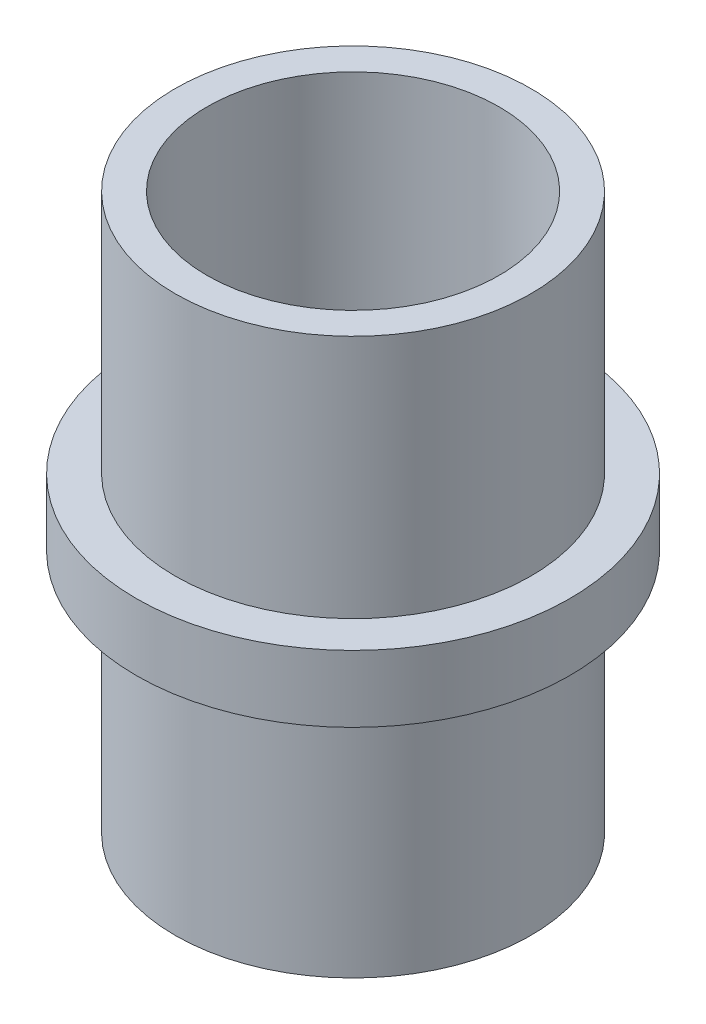
ISO-10303-21;
HEADER;
FILE_DESCRIPTION(('STEP AP214'),'2;1');
FILE_NAME('part.step','',(''),(''),'','','');
FILE_SCHEMA(('AUTOMOTIVE_DESIGN { 1 0 10303 214 1 1 1 1 }'));
ENDSEC;
DATA;
#1=APPLICATION_CONTEXT('core data for automotive mechanical design processes');
#2=APPLICATION_PROTOCOL_DEFINITION('international standard','automotive_design',2000,#1);
#3=PRODUCT_CONTEXT('',#1,'mechanical');
#4=PRODUCT('Part','Part','',(#3));
#5=PRODUCT_RELATED_PRODUCT_CATEGORY('part','',(#4));
#6=PRODUCT_DEFINITION_FORMATION('','',#4);
#7=PRODUCT_DEFINITION_CONTEXT('part definition',#1,'design');
#8=PRODUCT_DEFINITION('design','',#6,#7);
#9=PRODUCT_DEFINITION_SHAPE('','',#8);
#10=(LENGTH_UNIT() NAMED_UNIT(*) SI_UNIT(.MILLI.,.METRE.));
#11=(NAMED_UNIT(*) PLANE_ANGLE_UNIT() SI_UNIT($,.RADIAN.));
#12=(NAMED_UNIT(*) SI_UNIT($,.STERADIAN.) SOLID_ANGLE_UNIT());
#13=UNCERTAINTY_MEASURE_WITH_UNIT(LENGTH_MEASURE(1.E-05),#10,'distance_accuracy_value','');
#14=(GEOMETRIC_REPRESENTATION_CONTEXT(3) GLOBAL_UNCERTAINTY_ASSIGNED_CONTEXT((#13)) GLOBAL_UNIT_ASSIGNED_CONTEXT((#10,
#11,#12)) REPRESENTATION_CONTEXT('',''));
#15=CARTESIAN_POINT('',(0.,0.,0.));
#16=DIRECTION('',(0.,0.,1.));
#17=DIRECTION('',(1.,0.,0.));
#18=AXIS2_PLACEMENT_3D('',#15,#16,#17);
#19=CARTESIAN_POINT('',(0.,25.,0.));
#20=DIRECTION('',(0.,-1.,0.));
#21=DIRECTION('',(0.,0.,-1.));
#22=AXIS2_PLACEMENT_3D('',#19,#20,#21);
#23=CYLINDRICAL_SURFACE('',#22,16.);
#24=CARTESIAN_POINT('',(0.,-25.,0.));
#25=DIRECTION('',(0.,1.,0.));
#26=DIRECTION('',(0.,0.,1.));
#27=AXIS2_PLACEMENT_3D('',#24,#25,#26);
#28=CIRCLE('',#27,16.);
#29=CARTESIAN_POINT('',(0.,-25.,16.));
#30=VERTEX_POINT('',#29);
#31=EDGE_CURVE('E47',#30,#30,#28,.T.);
#32=ORIENTED_EDGE('',*,*,#31,.T.);
#33=EDGE_LOOP('',(#32));
#34=FACE_BOUND('',#33,.T.);
#35=CARTESIAN_POINT('',(0.,-3.,0.));
#36=DIRECTION('',(0.,1.,0.));
#37=DIRECTION('',(0.,0.,1.));
#38=AXIS2_PLACEMENT_3D('',#35,#36,#37);
#39=CIRCLE('',#38,16.);
#40=CARTESIAN_POINT('',(0.,-3.,16.));
#41=VERTEX_POINT('',#40);
#42=EDGE_CURVE('E10',#41,#41,#39,.T.);
#43=ORIENTED_EDGE('',*,*,#42,.F.);
#44=EDGE_LOOP('',(#43));
#45=FACE_BOUND('',#44,.T.);
#46=ADVANCED_FACE('F36',(#34,#45),#23,.T.);
#47=CARTESIAN_POINT('',(0.,25.,0.));
#48=DIRECTION('',(0.,1.,0.));
#49=DIRECTION('',(0.,0.,1.));
#50=AXIS2_PLACEMENT_3D('',#47,#48,#49);
#51=PLANE('',#50);
#52=CARTESIAN_POINT('',(0.,25.,0.));
#53=DIRECTION('',(0.,1.,0.));
#54=DIRECTION('',(0.,0.,1.));
#55=AXIS2_PLACEMENT_3D('',#52,#53,#54);
#56=CIRCLE('',#55,16.);
#57=CARTESIAN_POINT('',(0.,25.,16.));
#58=VERTEX_POINT('',#57);
#59=EDGE_CURVE('E43',#58,#58,#56,.T.);
#60=ORIENTED_EDGE('',*,*,#59,.T.);
#61=EDGE_LOOP('',(#60));
#62=FACE_BOUND('',#61,.T.);
#63=CARTESIAN_POINT('',(0.,25.,0.));
#64=DIRECTION('',(0.,1.,0.));
#65=DIRECTION('',(0.,0.,1.));
#66=AXIS2_PLACEMENT_3D('',#63,#64,#65);
#67=CIRCLE('',#66,13.1445);
#68=CARTESIAN_POINT('',(0.,25.,13.1445));
#69=VERTEX_POINT('',#68);
#70=EDGE_CURVE('E52',#69,#69,#67,.T.);
#71=ORIENTED_EDGE('',*,*,#70,.F.);
#72=EDGE_LOOP('',(#71));
#73=FACE_BOUND('',#72,.T.);
#74=ADVANCED_FACE('F105',(#62,#73),#51,.T.);
#75=CARTESIAN_POINT('',(0.,-25.,0.));
#76=DIRECTION('',(0.,1.,0.));
#77=DIRECTION('',(0.,0.,1.));
#78=AXIS2_PLACEMENT_3D('',#75,#76,#77);
#79=PLANE('',#78);
#80=ORIENTED_EDGE('',*,*,#31,.F.);
#81=EDGE_LOOP('',(#80));
#82=FACE_BOUND('',#81,.T.);
#83=CARTESIAN_POINT('',(0.,-25.,0.));
#84=DIRECTION('',(0.,1.,0.));
#85=DIRECTION('',(0.,0.,1.));
#86=AXIS2_PLACEMENT_3D('',#83,#84,#85);
#87=CIRCLE('',#86,13.1445);
#88=CARTESIAN_POINT('',(0.,-25.,13.1445));
#89=VERTEX_POINT('',#88);
#90=EDGE_CURVE('E54',#89,#89,#87,.T.);
#91=ORIENTED_EDGE('',*,*,#90,.T.);
#92=EDGE_LOOP('',(#91));
#93=FACE_BOUND('',#92,.T.);
#94=ADVANCED_FACE('F107',(#82,#93),#79,.F.);
#95=CARTESIAN_POINT('',(0.,3.,0.));
#96=DIRECTION('',(0.,1.,0.));
#97=DIRECTION('',(0.,0.,1.));
#98=AXIS2_PLACEMENT_3D('',#95,#96,#97);
#99=CIRCLE('',#98,16.);
#100=CARTESIAN_POINT('',(0.,3.,16.));
#101=VERTEX_POINT('',#100);
#102=EDGE_CURVE('E63',#101,#101,#99,.T.);
#103=ORIENTED_EDGE('',*,*,#102,.T.);
#104=EDGE_LOOP('',(#103));
#105=FACE_BOUND('',#104,.T.);
#106=ORIENTED_EDGE('',*,*,#59,.F.);
#107=EDGE_LOOP('',(#106));
#108=FACE_BOUND('',#107,.T.);
#109=ADVANCED_FACE('F38',(#105,#108),#23,.T.);
#110=CARTESIAN_POINT('',(0.,25.,0.));
#111=DIRECTION('',(0.,-1.,0.));
#112=DIRECTION('',(0.,0.,-1.));
#113=AXIS2_PLACEMENT_3D('',#110,#111,#112);
#114=CYLINDRICAL_SURFACE('',#113,13.1445);
#115=CARTESIAN_POINT('',(2.,0.,-12.9914541237692));
#116=CARTESIAN_POINT('',(1.99999540326032,-0.111641013446361,-12.9914560105317));
#117=CARTESIAN_POINT('',(1.99062059725548,-0.223346359076251,-12.9929087652028));
#118=CARTESIAN_POINT('',(1.95337981008824,-0.443632517787268,-12.9985587147258));
#119=CARTESIAN_POINT('',(1.92549591435574,-0.552210197328411,-13.0027585683812));
#120=CARTESIAN_POINT('',(1.85209166421764,-0.763020618672669,-13.0134162676637));
#121=CARTESIAN_POINT('',(1.80658499337819,-0.865258212085992,-13.0198723610086));
#122=CARTESIAN_POINT('',(1.69925941851024,-1.0606324803063,-13.0343130218612));
#123=CARTESIAN_POINT('',(1.63744270929411,-1.15377037733389,-13.042297383673));
#124=CARTESIAN_POINT('',(1.4987082723457,-1.32908235303009,-13.0589684492082));
#125=CARTESIAN_POINT('',(1.42168268312432,-1.41117063487943,-13.0676598924021));
#126=CARTESIAN_POINT('',(1.2549498927998,-1.56130948340432,-13.0847235374151));
#127=CARTESIAN_POINT('',(1.16524198832323,-1.62935927097631,-13.0930957214952));
#128=CARTESIAN_POINT('',(0.975140607841426,-1.74980669661211,-13.1086271879623));
#129=CARTESIAN_POINT('',(0.874696455380245,-1.80212522089739,-13.1157802638666));
#130=CARTESIAN_POINT('',(0.666319274849736,-1.88911718774773,-13.1280150318462));
#131=CARTESIAN_POINT('',(0.558386654054409,-1.92379158906707,-13.1330968364681));
#132=CARTESIAN_POINT('',(0.338980304740942,-1.97425065066266,-13.1405830418978));
#133=CARTESIAN_POINT('',(0.22754033831712,-1.990179045466,-13.1430078054685));
#134=CARTESIAN_POINT('',(0.00354483222252339,-2.00314033120742,-13.1449765342345));
#135=CARTESIAN_POINT('',(-0.109010643357356,-2.0001743015011,-13.144520663988));
#136=CARTESIAN_POINT('',(-0.331061226495416,-1.97554419760718,-13.1407957407721));
#137=CARTESIAN_POINT('',(-0.440573932925829,-1.95403476573691,-13.137549954908));
#138=CARTESIAN_POINT('',(-0.65441727942512,-1.89317126525896,-13.1286358216136));
#139=CARTESIAN_POINT('',(-0.758747782915367,-1.85381672661431,-13.1229674103721));
#140=CARTESIAN_POINT('',(-0.959732216494147,-1.75822240422397,-13.1098049884868));
#141=CARTESIAN_POINT('',(-1.05635478670677,-1.70191769010173,-13.1023039789832));
#142=CARTESIAN_POINT('',(-1.23883866807834,-1.57406872704859,-13.0863120213155));
#143=CARTESIAN_POINT('',(-1.32469925007181,-1.50252344639715,-13.07782100615));
#144=CARTESIAN_POINT('',(-1.48413371647281,-1.34536324665243,-13.0606942403334));
#145=CARTESIAN_POINT('',(-1.55757449219005,-1.25961329352903,-13.0520578945112));
#146=CARTESIAN_POINT('',(-1.68904475516849,-1.07693618437247,-13.0356975565115));
#147=CARTESIAN_POINT('',(-1.74707414224258,-0.980008955683409,-13.0279735702652));
#148=CARTESIAN_POINT('',(-1.84609338170574,-0.77758802636922,-13.0143125845104));
#149=CARTESIAN_POINT('',(-1.88706926216929,-0.672087385798994,-13.0083770513745));
#150=CARTESIAN_POINT('',(-1.95068287818991,-0.455590985669204,-12.9989907418615));
#151=CARTESIAN_POINT('',(-1.97332194551027,-0.344595625800696,-12.9955397850369));
#152=CARTESIAN_POINT('',(-1.99943613708535,-0.121445651919497,-12.9915476658772));
#153=CARTESIAN_POINT('',(-2.00310008261134,-0.00931362998938095,-12.9909778348409));
#154=CARTESIAN_POINT('',(-1.99166132005454,0.213962929558819,-12.9927363408862));
#155=CARTESIAN_POINT('',(-1.97655921174369,0.325107498622023,-12.9950645853441));
#156=CARTESIAN_POINT('',(-1.9281772859336,0.542667357892487,-13.00233055309));
#157=CARTESIAN_POINT('',(-1.89499179256298,0.649104116315826,-13.0072547315143));
#158=CARTESIAN_POINT('',(-1.81148332950313,0.854904583681825,-13.0191465407353));
#159=CARTESIAN_POINT('',(-1.7611594910007,0.954267933735512,-13.0261142751258));
#160=CARTESIAN_POINT('',(-1.64435017321235,1.14394670401394,-13.0413755336817));
#161=CARTESIAN_POINT('',(-1.57774261608489,1.23418613959437,-13.0496789021603));
#162=CARTESIAN_POINT('',(-1.43042604517261,1.40227385547233,-13.066646304704));
#163=CARTESIAN_POINT('',(-1.34971621017293,1.48012141365159,-13.0753103597506));
#164=CARTESIAN_POINT('',(-1.17565395528388,1.62189509577794,-13.0921126473338));
#165=CARTESIAN_POINT('',(-1.08219896184892,1.68569598639716,-13.1002457279962));
#166=CARTESIAN_POINT('',(-0.885788017201065,1.79669216691888,-13.114989313007));
#167=CARTESIAN_POINT('',(-0.782832332103547,1.84388792175486,-13.1215998599836));
#168=CARTESIAN_POINT('',(-0.57073118165908,1.92013466092894,-13.1325309968908));
#169=CARTESIAN_POINT('',(-0.461610661361911,1.94925375367337,-13.1368601730266));
#170=CARTESIAN_POINT('',(-0.239957819352454,1.9887408714026,-13.1427768615432));
#171=CARTESIAN_POINT('',(-0.127425730313675,1.99911017223594,-13.1443645604702));
#172=CARTESIAN_POINT('',(0.0966419845571877,2.00077152974065,-13.1446174396465));
#173=CARTESIAN_POINT('',(0.208176204704224,1.9922550692773,-13.1433119539983));
#174=CARTESIAN_POINT('',(0.428206858060825,1.95679755096329,-13.1379843914623));
#175=CARTESIAN_POINT('',(0.536703301823739,1.92985655712842,-13.1339623240133));
#176=CARTESIAN_POINT('',(0.747523447050995,1.85838335911471,-13.1236514793906));
#177=CARTESIAN_POINT('',(0.849851862561139,1.81386479060985,-13.1173644595675));
#178=CARTESIAN_POINT('',(1.04561655254692,1.70852069190517,-13.1032137280482));
#179=CARTESIAN_POINT('',(1.139052521433,1.64769460157021,-13.0953499621961));
#180=CARTESIAN_POINT('',(1.31535042796293,1.5107713719436,-13.0788248695553));
#181=CARTESIAN_POINT('',(1.39810202818488,1.4345329904455,-13.0701565996357));
#182=CARTESIAN_POINT('',(1.54970677038495,1.26924645455248,-13.053050406685));
#183=CARTESIAN_POINT('',(1.61855664731257,1.18019529925613,-13.0446125381689));
#184=CARTESIAN_POINT('',(1.74076286428721,0.991203531349238,-13.0288700386719));
#185=CARTESIAN_POINT('',(1.79402712671228,0.891202816676302,-13.0215722566867));
#186=CARTESIAN_POINT('',(1.88292345858472,0.683609691019864,-13.0090165852373));
#187=CARTESIAN_POINT('',(1.9185737421196,0.57602525427977,-13.0037565897798));
#188=CARTESIAN_POINT('',(1.96318223796475,0.389971147672344,-12.9970813004023));
#189=CARTESIAN_POINT('',(1.97696764792184,0.312647946307558,-12.9949823643144));
#190=CARTESIAN_POINT('',(1.99537808220644,0.156893745491239,-12.9921681223506));
#191=CARTESIAN_POINT('',(2.00000323064863,0.0784627610638357,-12.9914527977279));
#192=CARTESIAN_POINT('',(2.,0.,-12.9914541237692));
#193=B_SPLINE_CURVE_WITH_KNOTS('',3,(#115,#116,#117,#118,#119,#120,#121,#122,#123,#124,#125,
#126,#127,#128,#129,#130,#131,#132,#133,#134,#135,#136,#137,#138,#139,#140,#141,#142,#143,#144,
#145,#146,#147,#148,#149,#150,#151,#152,#153,#154,#155,#156,#157,#158,#159,#160,#161,#162,#163,
#164,#165,#166,#167,#168,#169,#170,#171,#172,#173,#174,#175,#176,#177,#178,#179,#180,#181,#182,
#183,#184,#185,#186,#187,#188,#189,#190,#191,#192),.UNSPECIFIED.,.T.,.F.,(4,2,2,2,2,2,2,2,2,2,2,
2,2,2,2,2,2,2,2,2,2,2,2,2,2,2,2,2,2,2,2,2,2,2,2,2,2,2,4),(0.,0.334636233759967,
0.669596828284552,1.0042978555757,1.33895386570624,1.67607451418428,2.01321386703868,
2.35202140399586,2.69081052871008,3.0269847133173,3.3631396939399,3.69651814012939,
4.02990536795852,4.36458630079505,4.6992898972898,5.03738007249228,5.37547244551408,
5.71384127464964,6.05218552658118,6.3871563578982,6.72211648366472,7.05534593055503,
7.3885922727319,7.72441797457518,8.06026323900444,8.39899130089748,8.73770987786035,
9.07514437529327,9.41255591079043,9.7465620849471,10.0805670986097,10.4143135178075,
10.7480714020862,11.0850391810841,11.4220860107352,11.7610856224558,12.0997339473096,
12.3349238457631,12.5701105575482),.UNSPECIFIED.);
#194=CARTESIAN_POINT('',(2.,0.,-12.9914541237692));
#195=VERTEX_POINT('',#194);
#196=EDGE_CURVE('E69',#195,#195,#193,.T.);
#197=ORIENTED_EDGE('',*,*,#196,.T.);
#198=EDGE_LOOP('',(#197));
#199=FACE_BOUND('',#198,.T.);
#200=ORIENTED_EDGE('',*,*,#70,.T.);
#201=EDGE_LOOP('',(#200));
#202=FACE_BOUND('',#201,.T.);
#203=ORIENTED_EDGE('',*,*,#90,.F.);
#204=EDGE_LOOP('',(#203));
#205=FACE_BOUND('',#204,.T.);
#206=ADVANCED_FACE('F94',(#199,#202,#205),#114,.F.);
#207=CARTESIAN_POINT('',(0.,3.,0.));
#208=DIRECTION('',(0.,1.,0.));
#209=DIRECTION('',(0.,0.,1.));
#210=AXIS2_PLACEMENT_3D('',#207,#208,#209);
#211=PLANE('',#210);
#212=CARTESIAN_POINT('',(0.,3.,0.));
#213=DIRECTION('',(0.,1.,0.));
#214=DIRECTION('',(0.,0.,1.));
#215=AXIS2_PLACEMENT_3D('',#212,#213,#214);
#216=CIRCLE('',#215,19.5);
#217=CARTESIAN_POINT('',(0.,3.,19.5));
#218=VERTEX_POINT('',#217);
#219=EDGE_CURVE('E57',#218,#218,#216,.T.);
#220=ORIENTED_EDGE('',*,*,#219,.T.);
#221=EDGE_LOOP('',(#220));
#222=FACE_BOUND('',#221,.T.);
#223=ORIENTED_EDGE('',*,*,#102,.F.);
#224=EDGE_LOOP('',(#223));
#225=FACE_BOUND('',#224,.T.);
#226=ADVANCED_FACE('F89',(#222,#225),#211,.T.);
#227=CARTESIAN_POINT('',(0.,-3.,0.));
#228=DIRECTION('',(0.,1.,0.));
#229=DIRECTION('',(0.,0.,1.));
#230=AXIS2_PLACEMENT_3D('',#227,#228,#229);
#231=PLANE('',#230);
#232=CARTESIAN_POINT('',(0.,-3.,0.));
#233=DIRECTION('',(0.,1.,0.));
#234=DIRECTION('',(0.,0.,1.));
#235=AXIS2_PLACEMENT_3D('',#232,#233,#234);
#236=CIRCLE('',#235,19.5);
#237=CARTESIAN_POINT('',(0.,-3.,19.5));
#238=VERTEX_POINT('',#237);
#239=EDGE_CURVE('E60',#238,#238,#236,.T.);
#240=ORIENTED_EDGE('',*,*,#239,.F.);
#241=EDGE_LOOP('',(#240));
#242=FACE_BOUND('',#241,.T.);
#243=ORIENTED_EDGE('',*,*,#42,.T.);
#244=EDGE_LOOP('',(#243));
#245=FACE_BOUND('',#244,.T.);
#246=ADVANCED_FACE('F93',(#242,#245),#231,.F.);
#247=CARTESIAN_POINT('',(0.,3.,0.));
#248=DIRECTION('',(0.,-1.,0.));
#249=DIRECTION('',(0.,0.,-1.));
#250=AXIS2_PLACEMENT_3D('',#247,#248,#249);
#251=CYLINDRICAL_SURFACE('',#250,19.5);
#252=CARTESIAN_POINT('',(2.,0.,-19.3971647412708));
#253=CARTESIAN_POINT('',(1.99999515498403,-0.112023432898497,-19.3971660862955));
#254=CARTESIAN_POINT('',(1.99055635866579,-0.224120562002443,-19.398145646451));
#255=CARTESIAN_POINT('',(1.95304634207056,-0.445205802626981,-19.4019574182508));
#256=CARTESIAN_POINT('',(1.92495468633543,-0.554190367386136,-19.4047916617758));
#257=CARTESIAN_POINT('',(1.85096650902042,-0.765816881479511,-19.4119884614688));
#258=CARTESIAN_POINT('',(1.80508090061991,-0.868462673791046,-19.416350080726));
#259=CARTESIAN_POINT('',(1.69682853909276,-1.0645738689424,-19.4261090366267));
#260=CARTESIAN_POINT('',(1.63446501696501,-1.15804106660354,-19.4315061701692));
#261=CARTESIAN_POINT('',(1.49477141995224,-1.33352058449501,-19.442751112519));
#262=CARTESIAN_POINT('',(1.4173912333398,-1.41549292224637,-19.4486003897046));
#263=CARTESIAN_POINT('',(1.24996802239677,-1.56531143243599,-19.4600772363726));
#264=CARTESIAN_POINT('',(1.15992441446707,-1.6331569534763,-19.4657047956218));
#265=CARTESIAN_POINT('',(0.969484761915486,-1.75293469000817,-19.4761186920135));
#266=CARTESIAN_POINT('',(0.869066296882529,-1.80483143617383,-19.4809031441958));
#267=CARTESIAN_POINT('',(0.66088298505466,-1.8910115251465,-19.4890757523583));
#268=CARTESIAN_POINT('',(0.553118326017946,-1.92529531792435,-19.4924639440092));
#269=CARTESIAN_POINT('',(0.333706185242855,-1.97515881530633,-19.4974519635801));
#270=CARTESIAN_POINT('',(0.222073791730636,-1.99080427322626,-19.4990580770264));
#271=CARTESIAN_POINT('',(-0.00224309125484488,-2.00315046652263,-19.50032235989));
#272=CARTESIAN_POINT('',(-0.114927552058715,-1.99985171664318,-19.4999805822347));
#273=CARTESIAN_POINT('',(-0.337703412749204,-1.97445644743818,-19.4973927312408));
#274=CARTESIAN_POINT('',(-0.447802967569463,-1.95243063401096,-19.4951538208241));
#275=CARTESIAN_POINT('',(-0.662734412572127,-1.8903166550158,-19.4890315205295));
#276=CARTESIAN_POINT('',(-0.767566231272237,-1.85022824441499,-19.4851481083426));
#277=CARTESIAN_POINT('',(-0.969208917931982,-1.75304972498911,-19.4761610606095));
#278=CARTESIAN_POINT('',(-1.06600463398567,-1.69592839170578,-19.4710551874865));
#279=CARTESIAN_POINT('',(-1.24866211015604,-1.56632816834822,-19.4601959851864));
#280=CARTESIAN_POINT('',(-1.33452353269818,-1.49384880430931,-19.4544426360301));
#281=CARTESIAN_POINT('',(-1.49328938324497,-1.3351924420653,-19.4429027024365));
#282=CARTESIAN_POINT('',(-1.56613234704964,-1.24895392556504,-19.4371160869226));
#283=CARTESIAN_POINT('',(-1.69631751187591,-1.06544036193162,-19.4261882106982));
#284=CARTESIAN_POINT('',(-1.75365968845308,-0.968165297394404,-19.4210469510056));
#285=CARTESIAN_POINT('',(-1.85121559867517,-0.765291989261355,-19.41199148497));
#286=CARTESIAN_POINT('',(-1.89142543134983,-0.659691856558335,-19.4080775581397));
#287=CARTESIAN_POINT('',(-1.95352606366893,-0.443189823864775,-19.401925637188));
#288=CARTESIAN_POINT('',(-1.97541745105795,-0.332288094095886,-19.3996875892966));
#289=CARTESIAN_POINT('',(-2.00018049704348,-0.108870851142509,-19.3971501804423));
#290=CARTESIAN_POINT('',(-2.00313819112237,0.00363503050209216,-19.3968420499933));
#291=CARTESIAN_POINT('',(-1.99017593811496,0.227540801369968,-19.3981762163897));
#292=CARTESIAN_POINT('',(-1.9742562596023,0.338940706305543,-19.3998184854862));
#293=CARTESIAN_POINT('',(-1.92406318723416,0.557220857956535,-19.4048604273274));
#294=CARTESIAN_POINT('',(-1.889830564753,0.664110577856332,-19.4082561955548));
#295=CARTESIAN_POINT('',(-1.80402499860733,0.870630793537939,-19.4164193483894));
#296=CARTESIAN_POINT('',(-1.75245163778131,0.970261114612162,-19.4211867659935));
#297=CARTESIAN_POINT('',(-1.63321341654562,1.15982627802947,-19.431577255231));
#298=CARTESIAN_POINT('',(-1.5654915987522,1.24972512650644,-19.4372033295689));
#299=CARTESIAN_POINT('',(-1.41596037051075,1.41691023570751,-19.4486674227104));
#300=CARTESIAN_POINT('',(-1.33415059303401,1.49419616772948,-19.4545054470327));
#301=CARTESIAN_POINT('',(-1.15839224184196,1.63425878521438,-19.4657621550075));
#302=CARTESIAN_POINT('',(-1.0643987886937,1.69697930690318,-19.471179163548));
#303=CARTESIAN_POINT('',(-0.867162572792641,1.8057440202851,-19.4809590410667));
#304=CARTESIAN_POINT('',(-0.763919942502616,1.85178845075851,-19.4853219251383));
#305=CARTESIAN_POINT('',(-0.551311228808035,1.92579900844707,-19.4924944200789));
#306=CARTESIAN_POINT('',(-0.441957008530644,1.95379892200538,-19.4953069324086));
#307=CARTESIAN_POINT('',(-0.220069043435314,1.99103586624218,-19.4990737077235));
#308=CARTESIAN_POINT('',(-0.107535393047461,2.00027345357502,-19.5000280258391));
#309=CARTESIAN_POINT('',(0.116965661296229,1.99971546287678,-19.4999708372938));
#310=CARTESIAN_POINT('',(0.228933294293405,1.99000701832821,-19.4989683301382));
#311=CARTESIAN_POINT('',(0.449637990915391,1.95201543352201,-19.4951279026433));
#312=CARTESIAN_POINT('',(0.558375052372692,1.92373228080223,-19.4922899810726));
#313=CARTESIAN_POINT('',(0.76953027025847,1.84941858475306,-19.485096635418));
#314=CARTESIAN_POINT('',(0.871949386761827,1.80339074565088,-19.4807414425706));
#315=CARTESIAN_POINT('',(1.06762208892449,1.69490348021149,-19.4709987303201));
#316=CARTESIAN_POINT('',(1.16087571289594,1.63244412256272,-19.4656112152324));
#317=CARTESIAN_POINT('',(1.33601676553482,1.49254038908172,-19.4543775851625));
#318=CARTESIAN_POINT('',(1.41785223344902,1.41503111771502,-19.4485295517821));
#319=CARTESIAN_POINT('',(1.56739334893432,1.24735668513357,-19.4370501510022));
#320=CARTESIAN_POINT('',(1.63509560567684,1.15718849546012,-19.4314188358613));
#321=CARTESIAN_POINT('',(1.75459208521652,0.966491676456882,-19.4209944411369));
#322=CARTESIAN_POINT('',(1.80634350657357,0.865936122078403,-19.4162036314803));
#323=CARTESIAN_POINT('',(1.89215738854691,0.657576652851796,-19.4080296667281));
#324=CARTESIAN_POINT('',(1.92623973561543,0.549781041738899,-19.4046449299613));
#325=CARTESIAN_POINT('',(1.96728002307457,0.367816407273779,-19.4005170175013));
#326=CARTESIAN_POINT('',(1.97953316592164,0.294809405820984,-19.3992658876056));
#327=CARTESIAN_POINT('',(1.99589473544343,0.147878973345176,-19.3975893073598));
#328=CARTESIAN_POINT('',(2.00000319857903,0.073955546426171,-19.3971638533134));
#329=CARTESIAN_POINT('',(2.,0.,-19.3971647412708));
#330=B_SPLINE_CURVE_WITH_KNOTS('',3,(#252,#253,#254,#255,#256,#257,#258,#259,#260,#261,#262,
#263,#264,#265,#266,#267,#268,#269,#270,#271,#272,#273,#274,#275,#276,#277,#278,#279,#280,#281,
#282,#283,#284,#285,#286,#287,#288,#289,#290,#291,#292,#293,#294,#295,#296,#297,#298,#299,#300,
#301,#302,#303,#304,#305,#306,#307,#308,#309,#310,#311,#312,#313,#314,#315,#316,#317,#318,#319,
#320,#321,#322,#323,#324,#325,#326,#327,#328,#329),.UNSPECIFIED.,.T.,.F.,(4,2,2,2,2,2,2,2,2,2,2,
2,2,2,2,2,2,2,2,2,2,2,2,2,2,2,2,2,2,2,2,2,2,2,2,2,2,2,4),(0.,0.33580021729941,0.671968934596157,
1.00793180206608,1.34382884256551,1.68086669430358,2.01792008366592,2.35571772812507,
2.69350674219483,3.030100523385,3.36668515883302,3.70200459997125,4.0373285901099,
4.37327110950004,4.70922399793363,5.0467233741842,5.38422328266131,5.72179999758338,
6.05936588099168,6.39539675575071,6.73142284976209,7.06670392028879,7.40199305716014,
7.73848275946201,8.07498122953968,8.41275644626175,8.75052682628377,9.08766291724024,
9.42478900565156,9.7603682925177,10.0959478045312,10.4314761956217,10.76700318413,
11.1040104584841,11.4410984946608,11.7790833307985,12.1166869363478,12.3383762659198,
12.5600646030635),.UNSPECIFIED.);
#331=CARTESIAN_POINT('',(2.,0.,-19.3971647412708));
#332=VERTEX_POINT('',#331);
#333=EDGE_CURVE('E68',#332,#332,#330,.T.);
#334=ORIENTED_EDGE('',*,*,#333,.F.);
#335=EDGE_LOOP('',(#334));
#336=FACE_BOUND('',#335,.T.);
#337=ORIENTED_EDGE('',*,*,#219,.F.);
#338=EDGE_LOOP('',(#337));
#339=FACE_BOUND('',#338,.T.);
#340=ORIENTED_EDGE('',*,*,#239,.T.);
#341=EDGE_LOOP('',(#340));
#342=FACE_BOUND('',#341,.T.);
#343=ADVANCED_FACE('F87',(#336,#339,#342),#251,.T.);
#344=CARTESIAN_POINT('',(0.,0.,-19.501));
#345=DIRECTION('',(0.,0.,1.));
#346=DIRECTION('',(1.,0.,0.));
#347=AXIS2_PLACEMENT_3D('',#344,#345,#346);
#348=CYLINDRICAL_SURFACE('',#347,2.);
#349=ORIENTED_EDGE('',*,*,#196,.F.);
#350=EDGE_LOOP('',(#349));
#351=FACE_BOUND('',#350,.T.);
#352=ORIENTED_EDGE('',*,*,#333,.T.);
#353=EDGE_LOOP('',(#352));
#354=FACE_BOUND('',#353,.T.);
#355=ADVANCED_FACE('F81',(#351,#354),#348,.F.);
#356=CLOSED_SHELL('',(#46,#74,#94,#109,#206,#226,#246,#343,#355));
#357=MANIFOLD_SOLID_BREP('B2',#356);
#358=ADVANCED_BREP_SHAPE_REPRESENTATION('',(#18,#357),#14);
#359=SHAPE_DEFINITION_REPRESENTATION(#9,#358);
ENDSEC;
END-ISO-10303-21;
